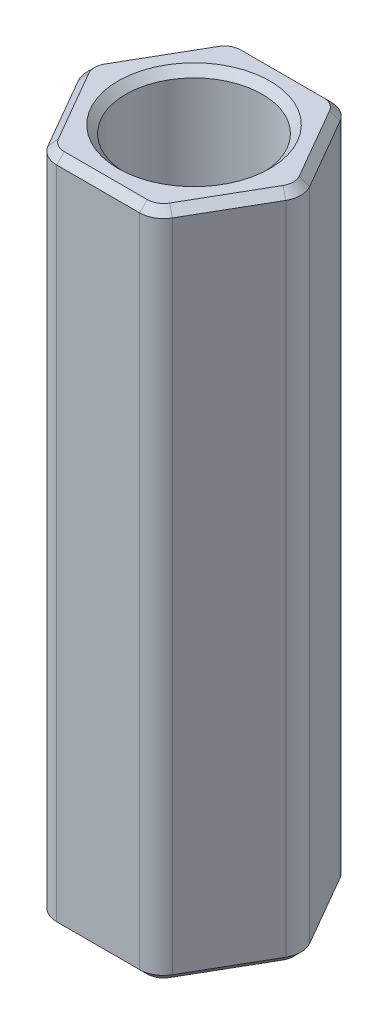
ISO-10303-21;
HEADER;
FILE_DESCRIPTION(('STEP AP214'),'2;1');
FILE_NAME('part.step','',(''),(''),'','','');
FILE_SCHEMA(('AUTOMOTIVE_DESIGN { 1 0 10303 214 1 1 1 1 }'));
ENDSEC;
DATA;
#1=APPLICATION_CONTEXT('core data for automotive mechanical design processes');
#2=APPLICATION_PROTOCOL_DEFINITION('international standard','automotive_design',2000,#1);
#3=PRODUCT_CONTEXT('',#1,'mechanical');
#4=PRODUCT('Part','Part','',(#3));
#5=PRODUCT_RELATED_PRODUCT_CATEGORY('part','',(#4));
#6=PRODUCT_DEFINITION_FORMATION('','',#4);
#7=PRODUCT_DEFINITION_CONTEXT('part definition',#1,'design');
#8=PRODUCT_DEFINITION('design','',#6,#7);
#9=PRODUCT_DEFINITION_SHAPE('','',#8);
#10=(LENGTH_UNIT() NAMED_UNIT(*) SI_UNIT(.MILLI.,.METRE.));
#11=(NAMED_UNIT(*) PLANE_ANGLE_UNIT() SI_UNIT($,.RADIAN.));
#12=(NAMED_UNIT(*) SI_UNIT($,.STERADIAN.) SOLID_ANGLE_UNIT());
#13=UNCERTAINTY_MEASURE_WITH_UNIT(LENGTH_MEASURE(1.E-05),#10,'distance_accuracy_value','');
#14=(GEOMETRIC_REPRESENTATION_CONTEXT(3) GLOBAL_UNCERTAINTY_ASSIGNED_CONTEXT((#13)) GLOBAL_UNIT_ASSIGNED_CONTEXT((#10,
#11,#12)) REPRESENTATION_CONTEXT('',''));
#15=CARTESIAN_POINT('',(0.,0.,0.));
#16=DIRECTION('',(0.,0.,1.));
#17=DIRECTION('',(1.,0.,0.));
#18=AXIS2_PLACEMENT_3D('',#15,#16,#17);
#19=CARTESIAN_POINT('',(1.83308710467706,5.55625,0.));
#20=DIRECTION('',(-0.866025403784439,0.,0.5));
#21=DIRECTION('',(0.5,0.,0.866025403784439));
#22=AXIS2_PLACEMENT_3D('',#19,#20,#21);
#23=PLANE('',#22);
#24=DIRECTION('',(0.,-1.,0.));
#25=VECTOR('',#24,1.);
#26=CARTESIAN_POINT('',(1.71851916063474,5.55625,-0.198437500000001));
#27=LINE('',#26,#25);
#28=CARTESIAN_POINT('',(1.71851916063474,5.42925,-0.198437500000001));
#29=VERTEX_POINT('',#28);
#30=CARTESIAN_POINT('',(1.71851916063474,-5.42925,-0.198437500000001));
#31=VERTEX_POINT('',#30);
#32=EDGE_CURVE('E404',#29,#31,#27,.T.);
#33=ORIENTED_EDGE('',*,*,#32,.T.);
#34=DIRECTION('',(-0.5,0.,-0.866025403784439));
#35=VECTOR('',#34,1.);
#36=CARTESIAN_POINT('',(1.83308710467706,-5.42925,0.));
#37=LINE('',#36,#35);
#38=CARTESIAN_POINT('',(1.03111149638085,-5.42925,-1.3890625));
#39=VERTEX_POINT('',#38);
#40=EDGE_CURVE('E325',#31,#39,#37,.T.);
#41=ORIENTED_EDGE('',*,*,#40,.T.);
#42=DIRECTION('',(0.,-1.,0.));
#43=VECTOR('',#42,1.);
#44=CARTESIAN_POINT('',(1.03111149638085,5.55625,-1.3890625));
#45=LINE('',#44,#43);
#46=CARTESIAN_POINT('',(1.03111149638085,5.42925,-1.3890625));
#47=VERTEX_POINT('',#46);
#48=EDGE_CURVE('E401',#39,#47,#45,.F.);
#49=ORIENTED_EDGE('',*,*,#48,.T.);
#50=DIRECTION('',(0.5,0.,0.866025403784439));
#51=VECTOR('',#50,1.);
#52=CARTESIAN_POINT('',(1.71851916063474,5.42925,-0.1984375));
#53=LINE('',#52,#51);
#54=EDGE_CURVE('E328',#47,#29,#53,.T.);
#55=ORIENTED_EDGE('',*,*,#54,.T.);
#56=EDGE_LOOP('',(#33,#41,#49,#55));
#57=FACE_BOUND('',#56,.T.);
#58=ADVANCED_FACE('F36',(#57),#23,.F.);
#59=CARTESIAN_POINT('',(0.91654355233853,5.55625,-1.5875));
#60=DIRECTION('',(0.,0.,1.));
#61=DIRECTION('',(1.,0.,0.));
#62=AXIS2_PLACEMENT_3D('',#59,#60,#61);
#63=PLANE('',#62);
#64=DIRECTION('',(0.,-1.,0.));
#65=VECTOR('',#64,1.);
#66=CARTESIAN_POINT('',(0.687407664253898,5.55625,-1.5875));
#67=LINE('',#66,#65);
#68=CARTESIAN_POINT('',(0.687407664253898,5.42925,-1.5875));
#69=VERTEX_POINT('',#68);
#70=CARTESIAN_POINT('',(0.687407664253898,-5.42925,-1.5875));
#71=VERTEX_POINT('',#70);
#72=EDGE_CURVE('E410',#69,#71,#67,.T.);
#73=ORIENTED_EDGE('',*,*,#72,.T.);
#74=DIRECTION('',(-1.,0.,0.));
#75=VECTOR('',#74,1.);
#76=CARTESIAN_POINT('',(0.91654355233853,-5.42925,-1.5875));
#77=LINE('',#76,#75);
#78=CARTESIAN_POINT('',(-0.687407664253898,-5.42925,-1.5875));
#79=VERTEX_POINT('',#78);
#80=EDGE_CURVE('E313',#71,#79,#77,.T.);
#81=ORIENTED_EDGE('',*,*,#80,.T.);
#82=DIRECTION('',(0.,-1.,0.));
#83=VECTOR('',#82,1.);
#84=CARTESIAN_POINT('',(-0.687407664253898,5.55625,-1.5875));
#85=LINE('',#84,#83);
#86=CARTESIAN_POINT('',(-0.687407664253898,5.42925,-1.5875));
#87=VERTEX_POINT('',#86);
#88=EDGE_CURVE('E407',#79,#87,#85,.F.);
#89=ORIENTED_EDGE('',*,*,#88,.T.);
#90=DIRECTION('',(1.,0.,0.));
#91=VECTOR('',#90,1.);
#92=CARTESIAN_POINT('',(0.687407664253898,5.42925,-1.5875));
#93=LINE('',#92,#91);
#94=EDGE_CURVE('E315',#87,#69,#93,.T.);
#95=ORIENTED_EDGE('',*,*,#94,.T.);
#96=EDGE_LOOP('',(#73,#81,#89,#95));
#97=FACE_BOUND('',#96,.T.);
#98=ADVANCED_FACE('F439',(#97),#63,.F.);
#99=CARTESIAN_POINT('',(-0.916543552338531,5.55625,-1.5875));
#100=DIRECTION('',(0.866025403784439,0.,0.499999999999999));
#101=DIRECTION('',(0.5,0.,-0.866025403784439));
#102=AXIS2_PLACEMENT_3D('',#99,#100,#101);
#103=PLANE('',#102);
#104=DIRECTION('',(0.,-1.,0.));
#105=VECTOR('',#104,1.);
#106=CARTESIAN_POINT('',(-1.03111149638085,5.55625,-1.3890625));
#107=LINE('',#106,#105);
#108=CARTESIAN_POINT('',(-1.03111149638085,5.42925,-1.3890625));
#109=VERTEX_POINT('',#108);
#110=CARTESIAN_POINT('',(-1.03111149638085,-5.42925,-1.3890625));
#111=VERTEX_POINT('',#110);
#112=EDGE_CURVE('E413',#109,#111,#107,.T.);
#113=ORIENTED_EDGE('',*,*,#112,.T.);
#114=DIRECTION('',(-0.5,0.,0.866025403784439));
#115=VECTOR('',#114,1.);
#116=CARTESIAN_POINT('',(-0.916543552338531,-5.42925,-1.5875));
#117=LINE('',#116,#115);
#118=CARTESIAN_POINT('',(-1.71851916063474,-5.42925,-0.1984375));
#119=VERTEX_POINT('',#118);
#120=EDGE_CURVE('E297',#111,#119,#117,.T.);
#121=ORIENTED_EDGE('',*,*,#120,.T.);
#122=DIRECTION('',(0.,-1.,0.));
#123=VECTOR('',#122,1.);
#124=CARTESIAN_POINT('',(-1.71851916063474,5.55625,-0.1984375));
#125=LINE('',#124,#123);
#126=CARTESIAN_POINT('',(-1.71851916063474,5.42925,-0.1984375));
#127=VERTEX_POINT('',#126);
#128=EDGE_CURVE('E255',#119,#127,#125,.F.);
#129=ORIENTED_EDGE('',*,*,#128,.T.);
#130=DIRECTION('',(0.5,0.,-0.866025403784439));
#131=VECTOR('',#130,1.);
#132=CARTESIAN_POINT('',(-1.03111149638085,5.42925,-1.3890625));
#133=LINE('',#132,#131);
#134=EDGE_CURVE('E299',#127,#109,#133,.T.);
#135=ORIENTED_EDGE('',*,*,#134,.T.);
#136=EDGE_LOOP('',(#113,#121,#129,#135));
#137=FACE_BOUND('',#136,.T.);
#138=ADVANCED_FACE('F419',(#137),#103,.F.);
#139=CARTESIAN_POINT('',(-1.83308710467706,5.55625,0.));
#140=DIRECTION('',(0.866025403784438,0.,-0.5));
#141=DIRECTION('',(-0.5,0.,-0.866025403784439));
#142=AXIS2_PLACEMENT_3D('',#139,#140,#141);
#143=PLANE('',#142);
#144=DIRECTION('',(0.,-1.,0.));
#145=VECTOR('',#144,1.);
#146=CARTESIAN_POINT('',(-1.71851916063474,5.55625,0.1984375));
#147=LINE('',#146,#145);
#148=CARTESIAN_POINT('',(-1.71851916063474,5.42925,0.1984375));
#149=VERTEX_POINT('',#148);
#150=CARTESIAN_POINT('',(-1.71851916063474,-5.42925,0.1984375));
#151=VERTEX_POINT('',#150);
#152=EDGE_CURVE('E387',#149,#151,#147,.T.);
#153=ORIENTED_EDGE('',*,*,#152,.T.);
#154=DIRECTION('',(0.5,0.,0.866025403784439));
#155=VECTOR('',#154,1.);
#156=CARTESIAN_POINT('',(-1.83308710467706,-5.42925,0.));
#157=LINE('',#156,#155);
#158=CARTESIAN_POINT('',(-1.03111149638085,-5.42925,1.3890625));
#159=VERTEX_POINT('',#158);
#160=EDGE_CURVE('E11',#151,#159,#157,.T.);
#161=ORIENTED_EDGE('',*,*,#160,.T.);
#162=DIRECTION('',(0.,-1.,0.));
#163=VECTOR('',#162,1.);
#164=CARTESIAN_POINT('',(-1.03111149638085,5.55625,1.3890625));
#165=LINE('',#164,#163);
#166=CARTESIAN_POINT('',(-1.03111149638085,5.42925,1.3890625));
#167=VERTEX_POINT('',#166);
#168=EDGE_CURVE('E385',#159,#167,#165,.F.);
#169=ORIENTED_EDGE('',*,*,#168,.T.);
#170=DIRECTION('',(-0.5,0.,-0.866025403784439));
#171=VECTOR('',#170,1.);
#172=CARTESIAN_POINT('',(-1.71851916063474,5.42925,0.1984375));
#173=LINE('',#172,#171);
#174=EDGE_CURVE('E45',#167,#149,#173,.T.);
#175=ORIENTED_EDGE('',*,*,#174,.T.);
#176=EDGE_LOOP('',(#153,#161,#169,#175));
#177=FACE_BOUND('',#176,.T.);
#178=ADVANCED_FACE('F817',(#177),#143,.F.);
#179=CARTESIAN_POINT('',(-0.916543552338529,5.55625,1.5875));
#180=DIRECTION('',(0.,0.,-1.));
#181=DIRECTION('',(-1.,0.,0.));
#182=AXIS2_PLACEMENT_3D('',#179,#180,#181);
#183=PLANE('',#182);
#184=DIRECTION('',(0.,-1.,0.));
#185=VECTOR('',#184,1.);
#186=CARTESIAN_POINT('',(-0.687407664253896,5.55625,1.5875));
#187=LINE('',#186,#185);
#188=CARTESIAN_POINT('',(-0.687407664253896,5.42925,1.5875));
#189=VERTEX_POINT('',#188);
#190=CARTESIAN_POINT('',(-0.687407664253896,-5.42925,1.5875));
#191=VERTEX_POINT('',#190);
#192=EDGE_CURVE('E392',#189,#191,#187,.T.);
#193=ORIENTED_EDGE('',*,*,#192,.T.);
#194=DIRECTION('',(1.,0.,0.));
#195=VECTOR('',#194,1.);
#196=CARTESIAN_POINT('',(-0.916543552338529,-5.42925,1.5875));
#197=LINE('',#196,#195);
#198=CARTESIAN_POINT('',(0.687407664253898,-5.42925,1.5875));
#199=VERTEX_POINT('',#198);
#200=EDGE_CURVE('E293',#191,#199,#197,.T.);
#201=ORIENTED_EDGE('',*,*,#200,.T.);
#202=DIRECTION('',(0.,-1.,0.));
#203=VECTOR('',#202,1.);
#204=CARTESIAN_POINT('',(0.687407664253898,5.55625,1.5875));
#205=LINE('',#204,#203);
#206=CARTESIAN_POINT('',(0.687407664253898,5.42925,1.5875));
#207=VERTEX_POINT('',#206);
#208=EDGE_CURVE('E389',#199,#207,#205,.F.);
#209=ORIENTED_EDGE('',*,*,#208,.T.);
#210=DIRECTION('',(-1.,0.,0.));
#211=VECTOR('',#210,1.);
#212=CARTESIAN_POINT('',(-0.687407664253896,5.42925,1.5875));
#213=LINE('',#212,#211);
#214=EDGE_CURVE('E295',#207,#189,#213,.T.);
#215=ORIENTED_EDGE('',*,*,#214,.T.);
#216=EDGE_LOOP('',(#193,#201,#209,#215));
#217=FACE_BOUND('',#216,.T.);
#218=ADVANCED_FACE('F808',(#217),#183,.F.);
#219=CARTESIAN_POINT('',(0.916543552338531,5.55625,1.5875));
#220=DIRECTION('',(-0.866025403784439,0.,-0.5));
#221=DIRECTION('',(-0.5,0.,0.866025403784439));
#222=AXIS2_PLACEMENT_3D('',#219,#220,#221);
#223=PLANE('',#222);
#224=DIRECTION('',(0.,-1.,0.));
#225=VECTOR('',#224,1.);
#226=CARTESIAN_POINT('',(1.03111149638085,5.55625,1.3890625));
#227=LINE('',#226,#225);
#228=CARTESIAN_POINT('',(1.03111149638085,5.42925,1.3890625));
#229=VERTEX_POINT('',#228);
#230=CARTESIAN_POINT('',(1.03111149638085,-5.42925,1.3890625));
#231=VERTEX_POINT('',#230);
#232=EDGE_CURVE('E398',#229,#231,#227,.T.);
#233=ORIENTED_EDGE('',*,*,#232,.T.);
#234=DIRECTION('',(0.5,0.,-0.866025403784439));
#235=VECTOR('',#234,1.);
#236=CARTESIAN_POINT('',(0.916543552338531,-5.42925,1.5875));
#237=LINE('',#236,#235);
#238=CARTESIAN_POINT('',(1.71851916063474,-5.42925,0.198437499999999));
#239=VERTEX_POINT('',#238);
#240=EDGE_CURVE('E309',#231,#239,#237,.T.);
#241=ORIENTED_EDGE('',*,*,#240,.T.);
#242=DIRECTION('',(0.,-1.,0.));
#243=VECTOR('',#242,1.);
#244=CARTESIAN_POINT('',(1.71851916063474,5.55625,0.198437499999999));
#245=LINE('',#244,#243);
#246=CARTESIAN_POINT('',(1.71851916063474,5.42925,0.198437499999999));
#247=VERTEX_POINT('',#246);
#248=EDGE_CURVE('E395',#239,#247,#245,.F.);
#249=ORIENTED_EDGE('',*,*,#248,.T.);
#250=DIRECTION('',(-0.5,0.,0.866025403784439));
#251=VECTOR('',#250,1.);
#252=CARTESIAN_POINT('',(1.03111149638085,5.42925,1.3890625));
#253=LINE('',#252,#251);
#254=EDGE_CURVE('E311',#247,#229,#253,.T.);
#255=ORIENTED_EDGE('',*,*,#254,.T.);
#256=EDGE_LOOP('',(#233,#241,#249,#255));
#257=FACE_BOUND('',#256,.T.);
#258=ADVANCED_FACE('F799',(#257),#223,.F.);
#259=CARTESIAN_POINT('',(0.,5.55625,0.));
#260=DIRECTION('',(0.,1.,0.));
#261=DIRECTION('',(0.,0.,1.));
#262=AXIS2_PLACEMENT_3D('',#259,#260,#261);
#263=PLANE('',#262);
#264=CARTESIAN_POINT('',(0.,5.55625,0.));
#265=DIRECTION('',(0.,1.,0.));
#266=DIRECTION('',(0.,0.,1.));
#267=AXIS2_PLACEMENT_3D('',#264,#265,#266);
#268=CIRCLE('',#267,1.25729999999998);
#269=CARTESIAN_POINT('',(0.,5.55625,1.25729999999998));
#270=VERTEX_POINT('',#269);
#271=EDGE_CURVE('E359',#270,#270,#268,.F.);
#272=ORIENTED_EDGE('',*,*,#271,.T.);
#273=EDGE_LOOP('',(#272));
#274=FACE_BOUND('',#273,.T.);
#275=CARTESIAN_POINT('',(1.3748153285078,5.55625,0.));
#276=DIRECTION('',(0.,1.,0.));
#277=DIRECTION('',(0.,0.,1.));
#278=AXIS2_PLACEMENT_3D('',#275,#276,#277);
#279=CIRCLE('',#278,0.269874999999997);
#280=CARTESIAN_POINT('',(1.60853393435412,5.55625,0.134937499999998));
#281=VERTEX_POINT('',#280);
#282=CARTESIAN_POINT('',(1.60853393435412,5.55625,-0.134937499999999));
#283=VERTEX_POINT('',#282);
#284=EDGE_CURVE('E367',#281,#283,#279,.T.);
#285=ORIENTED_EDGE('',*,*,#284,.T.);
#286=DIRECTION('',(-0.5,0.,-0.866025403784439));
#287=VECTOR('',#286,1.);
#288=CARTESIAN_POINT('',(0.921126270100221,5.55625,-1.3255625));
#289=LINE('',#288,#287);
#290=CARTESIAN_POINT('',(0.921126270100221,5.55625,-1.3255625));
#291=VERTEX_POINT('',#290);
#292=EDGE_CURVE('E362',#283,#291,#289,.T.);
#293=ORIENTED_EDGE('',*,*,#292,.T.);
#294=CARTESIAN_POINT('',(0.687407664253898,5.55625,-1.190625));
#295=DIRECTION('',(0.,1.,0.));
#296=DIRECTION('',(0.,0.,1.));
#297=AXIS2_PLACEMENT_3D('',#294,#295,#296);
#298=CIRCLE('',#297,0.269874999999997);
#299=CARTESIAN_POINT('',(0.687407664253898,5.55625,-1.4605));
#300=VERTEX_POINT('',#299);
#301=EDGE_CURVE('E365',#291,#300,#298,.T.);
#302=ORIENTED_EDGE('',*,*,#301,.T.);
#303=DIRECTION('',(-1.,0.,0.));
#304=VECTOR('',#303,1.);
#305=CARTESIAN_POINT('',(-0.687407664253898,5.55625,-1.4605));
#306=LINE('',#305,#304);
#307=CARTESIAN_POINT('',(-0.687407664253898,5.55625,-1.4605));
#308=VERTEX_POINT('',#307);
#309=EDGE_CURVE('E369',#300,#308,#306,.T.);
#310=ORIENTED_EDGE('',*,*,#309,.T.);
#311=CARTESIAN_POINT('',(-0.687407664253898,5.55625,-1.190625));
#312=DIRECTION('',(0.,1.,0.));
#313=DIRECTION('',(0.,0.,1.));
#314=AXIS2_PLACEMENT_3D('',#311,#312,#313);
#315=CIRCLE('',#314,0.269874999999997);
#316=CARTESIAN_POINT('',(-0.921126270100221,5.55625,-1.3255625));
#317=VERTEX_POINT('',#316);
#318=EDGE_CURVE('E373',#308,#317,#315,.T.);
#319=ORIENTED_EDGE('',*,*,#318,.T.);
#320=DIRECTION('',(-0.5,0.,0.866025403784439));
#321=VECTOR('',#320,1.);
#322=CARTESIAN_POINT('',(-1.60853393435412,5.55625,-0.134937499999998));
#323=LINE('',#322,#321);
#324=CARTESIAN_POINT('',(-1.60853393435412,5.55625,-0.134937499999998));
#325=VERTEX_POINT('',#324);
#326=EDGE_CURVE('E204',#317,#325,#323,.T.);
#327=ORIENTED_EDGE('',*,*,#326,.T.);
#328=CARTESIAN_POINT('',(-1.3748153285078,5.55625,0.));
#329=DIRECTION('',(0.,1.,0.));
#330=DIRECTION('',(0.,0.,1.));
#331=AXIS2_PLACEMENT_3D('',#328,#329,#330);
#332=CIRCLE('',#331,0.269874999999997);
#333=CARTESIAN_POINT('',(-1.60853393435412,5.55625,0.134937499999999));
#334=VERTEX_POINT('',#333);
#335=EDGE_CURVE('E198',#325,#334,#332,.T.);
#336=ORIENTED_EDGE('',*,*,#335,.T.);
#337=DIRECTION('',(0.5,0.,0.866025403784439));
#338=VECTOR('',#337,1.);
#339=CARTESIAN_POINT('',(-0.92112627010022,5.55625,1.3255625));
#340=LINE('',#339,#338);
#341=CARTESIAN_POINT('',(-0.92112627010022,5.55625,1.3255625));
#342=VERTEX_POINT('',#341);
#343=EDGE_CURVE('E201',#334,#342,#340,.T.);
#344=ORIENTED_EDGE('',*,*,#343,.T.);
#345=CARTESIAN_POINT('',(-0.687407664253897,5.55625,1.190625));
#346=DIRECTION('',(0.,1.,0.));
#347=DIRECTION('',(0.,0.,1.));
#348=AXIS2_PLACEMENT_3D('',#345,#346,#347);
#349=CIRCLE('',#348,0.269874999999997);
#350=CARTESIAN_POINT('',(-0.687407664253896,5.55625,1.4605));
#351=VERTEX_POINT('',#350);
#352=EDGE_CURVE('E210',#342,#351,#349,.T.);
#353=ORIENTED_EDGE('',*,*,#352,.T.);
#354=DIRECTION('',(1.,0.,0.));
#355=VECTOR('',#354,1.);
#356=CARTESIAN_POINT('',(0.687407664253898,5.55625,1.4605));
#357=LINE('',#356,#355);
#358=CARTESIAN_POINT('',(0.687407664253898,5.55625,1.4605));
#359=VERTEX_POINT('',#358);
#360=EDGE_CURVE('E209',#351,#359,#357,.T.);
#361=ORIENTED_EDGE('',*,*,#360,.T.);
#362=CARTESIAN_POINT('',(0.687407664253898,5.55625,1.190625));
#363=DIRECTION('',(0.,1.,0.));
#364=DIRECTION('',(0.,0.,1.));
#365=AXIS2_PLACEMENT_3D('',#362,#363,#364);
#366=CIRCLE('',#365,0.269874999999997);
#367=CARTESIAN_POINT('',(0.921126270100221,5.55625,1.3255625));
#368=VERTEX_POINT('',#367);
#369=EDGE_CURVE('E375',#359,#368,#366,.T.);
#370=ORIENTED_EDGE('',*,*,#369,.T.);
#371=DIRECTION('',(0.5,0.,-0.866025403784439));
#372=VECTOR('',#371,1.);
#373=CARTESIAN_POINT('',(1.60853393435412,5.55625,0.134937499999998));
#374=LINE('',#373,#372);
#375=EDGE_CURVE('E371',#368,#281,#374,.T.);
#376=ORIENTED_EDGE('',*,*,#375,.T.);
#377=EDGE_LOOP('',(#285,#293,#302,#310,#319,#327,#336,#344,#353,#361,#370,#376));
#378=FACE_BOUND('',#377,.T.);
#379=ADVANCED_FACE('F200',(#274,#378),#263,.T.);
#380=CARTESIAN_POINT('',(0.,-5.55625,0.));
#381=DIRECTION('',(0.,1.,0.));
#382=DIRECTION('',(0.,0.,1.));
#383=AXIS2_PLACEMENT_3D('',#380,#381,#382);
#384=PLANE('',#383);
#385=CARTESIAN_POINT('',(0.,-5.55625,0.));
#386=DIRECTION('',(0.,1.,0.));
#387=DIRECTION('',(0.,0.,1.));
#388=AXIS2_PLACEMENT_3D('',#385,#386,#387);
#389=CIRCLE('',#388,1.2573);
#390=CARTESIAN_POINT('',(0.,-5.55625,1.2573));
#391=VERTEX_POINT('',#390);
#392=EDGE_CURVE('E331',#391,#391,#389,.T.);
#393=ORIENTED_EDGE('',*,*,#392,.T.);
#394=EDGE_LOOP('',(#393));
#395=FACE_BOUND('',#394,.T.);
#396=CARTESIAN_POINT('',(0.687407664253898,-5.55625,-1.190625));
#397=DIRECTION('',(0.,1.,0.));
#398=DIRECTION('',(0.,0.,1.));
#399=AXIS2_PLACEMENT_3D('',#396,#397,#398);
#400=CIRCLE('',#399,0.269874999999995);
#401=CARTESIAN_POINT('',(0.687407664253898,-5.55625,-1.46049999999999));
#402=VERTEX_POINT('',#401);
#403=CARTESIAN_POINT('',(0.921126270100219,-5.55625,-1.3255625));
#404=VERTEX_POINT('',#403);
#405=EDGE_CURVE('E337',#402,#404,#400,.F.);
#406=ORIENTED_EDGE('',*,*,#405,.T.);
#407=DIRECTION('',(0.5,0.,0.866025403784439));
#408=VECTOR('',#407,1.);
#409=CARTESIAN_POINT('',(1.26483010222717,-5.55625,-0.730249999999997));
#410=LINE('',#409,#408);
#411=CARTESIAN_POINT('',(1.60853393435412,-5.55625,-0.134937499999998));
#412=VERTEX_POINT('',#411);
#413=EDGE_CURVE('E334',#404,#412,#410,.T.);
#414=ORIENTED_EDGE('',*,*,#413,.T.);
#415=CARTESIAN_POINT('',(1.3748153285078,-5.55625,0.));
#416=DIRECTION('',(0.,1.,0.));
#417=DIRECTION('',(0.,0.,1.));
#418=AXIS2_PLACEMENT_3D('',#415,#416,#417);
#419=CIRCLE('',#418,0.269874999999995);
#420=CARTESIAN_POINT('',(1.60853393435412,-5.55625,0.134937499999997));
#421=VERTEX_POINT('',#420);
#422=EDGE_CURVE('E339',#412,#421,#419,.F.);
#423=ORIENTED_EDGE('',*,*,#422,.T.);
#424=DIRECTION('',(-0.5,0.,0.866025403784439));
#425=VECTOR('',#424,1.);
#426=CARTESIAN_POINT('',(1.26483010222717,-5.55625,0.730249999999997));
#427=LINE('',#426,#425);
#428=CARTESIAN_POINT('',(0.921126270100219,-5.55625,1.3255625));
#429=VERTEX_POINT('',#428);
#430=EDGE_CURVE('E343',#421,#429,#427,.T.);
#431=ORIENTED_EDGE('',*,*,#430,.T.);
#432=CARTESIAN_POINT('',(0.687407664253898,-5.55625,1.190625));
#433=DIRECTION('',(0.,1.,0.));
#434=DIRECTION('',(0.,0.,1.));
#435=AXIS2_PLACEMENT_3D('',#432,#433,#434);
#436=CIRCLE('',#435,0.269874999999995);
#437=CARTESIAN_POINT('',(0.687407664253898,-5.55625,1.46049999999999));
#438=VERTEX_POINT('',#437);
#439=EDGE_CURVE('E347',#429,#438,#436,.F.);
#440=ORIENTED_EDGE('',*,*,#439,.T.);
#441=DIRECTION('',(-1.,0.,0.));
#442=VECTOR('',#441,1.);
#443=CARTESIAN_POINT('',(0.,-5.55625,1.46049999999999));
#444=LINE('',#443,#442);
#445=CARTESIAN_POINT('',(-0.687407664253896,-5.55625,1.46049999999999));
#446=VERTEX_POINT('',#445);
#447=EDGE_CURVE('E351',#438,#446,#444,.T.);
#448=ORIENTED_EDGE('',*,*,#447,.T.);
#449=CARTESIAN_POINT('',(-0.687407664253897,-5.55625,1.190625));
#450=DIRECTION('',(0.,1.,0.));
#451=DIRECTION('',(0.,0.,1.));
#452=AXIS2_PLACEMENT_3D('',#449,#450,#451);
#453=CIRCLE('',#452,0.269874999999995);
#454=CARTESIAN_POINT('',(-0.921126270100218,-5.55625,1.3255625));
#455=VERTEX_POINT('',#454);
#456=EDGE_CURVE('E355',#446,#455,#453,.F.);
#457=ORIENTED_EDGE('',*,*,#456,.T.);
#458=DIRECTION('',(-0.5,0.,-0.866025403784439));
#459=VECTOR('',#458,1.);
#460=CARTESIAN_POINT('',(-1.26483010222717,-5.55625,0.730249999999997));
#461=LINE('',#460,#459);
#462=CARTESIAN_POINT('',(-1.60853393435412,-5.55625,0.134937499999998));
#463=VERTEX_POINT('',#462);
#464=EDGE_CURVE('E357',#455,#463,#461,.T.);
#465=ORIENTED_EDGE('',*,*,#464,.T.);
#466=CARTESIAN_POINT('',(-1.3748153285078,-5.55625,0.));
#467=DIRECTION('',(0.,1.,0.));
#468=DIRECTION('',(0.,0.,1.));
#469=AXIS2_PLACEMENT_3D('',#466,#467,#468);
#470=CIRCLE('',#469,0.269874999999995);
#471=CARTESIAN_POINT('',(-1.60853393435412,-5.55625,-0.134937499999997));
#472=VERTEX_POINT('',#471);
#473=EDGE_CURVE('E353',#463,#472,#470,.F.);
#474=ORIENTED_EDGE('',*,*,#473,.T.);
#475=DIRECTION('',(0.5,0.,-0.866025403784439));
#476=VECTOR('',#475,1.);
#477=CARTESIAN_POINT('',(-1.26483010222717,-5.55625,-0.730249999999996));
#478=LINE('',#477,#476);
#479=CARTESIAN_POINT('',(-0.921126270100219,-5.55625,-1.3255625));
#480=VERTEX_POINT('',#479);
#481=EDGE_CURVE('E349',#472,#480,#478,.T.);
#482=ORIENTED_EDGE('',*,*,#481,.T.);
#483=CARTESIAN_POINT('',(-0.687407664253898,-5.55625,-1.190625));
#484=DIRECTION('',(0.,1.,0.));
#485=DIRECTION('',(0.,0.,1.));
#486=AXIS2_PLACEMENT_3D('',#483,#484,#485);
#487=CIRCLE('',#486,0.269874999999995);
#488=CARTESIAN_POINT('',(-0.687407664253898,-5.55625,-1.46049999999999));
#489=VERTEX_POINT('',#488);
#490=EDGE_CURVE('E345',#480,#489,#487,.F.);
#491=ORIENTED_EDGE('',*,*,#490,.T.);
#492=DIRECTION('',(1.,0.,0.));
#493=VECTOR('',#492,1.);
#494=CARTESIAN_POINT('',(0.,-5.55625,-1.46049999999999));
#495=LINE('',#494,#493);
#496=EDGE_CURVE('E341',#489,#402,#495,.T.);
#497=ORIENTED_EDGE('',*,*,#496,.T.);
#498=EDGE_LOOP('',(#406,#414,#423,#431,#440,#448,#457,#465,#474,#482,#491,#497));
#499=FACE_BOUND('',#498,.T.);
#500=ADVANCED_FACE('F454',(#395,#499),#384,.F.);
#501=CARTESIAN_POINT('',(0.,5.55625,0.));
#502=DIRECTION('',(0.,1.,0.));
#503=DIRECTION('',(0.,0.,1.));
#504=AXIS2_PLACEMENT_3D('',#501,#502,#503);
#505=CYLINDRICAL_SURFACE('',#504,1.13029999999999);
#506=CARTESIAN_POINT('',(0.,5.42925000000001,0.));
#507=DIRECTION('',(0.,1.,0.));
#508=DIRECTION('',(0.,0.,1.));
#509=AXIS2_PLACEMENT_3D('',#506,#507,#508);
#510=CIRCLE('',#509,1.13029999999999);
#511=CARTESIAN_POINT('',(0.,5.42925000000001,1.13029999999999));
#512=VERTEX_POINT('',#511);
#513=EDGE_CURVE('E219',#512,#512,#510,.T.);
#514=ORIENTED_EDGE('',*,*,#513,.T.);
#515=EDGE_LOOP('',(#514));
#516=FACE_BOUND('',#515,.T.);
#517=CARTESIAN_POINT('',(0.,-5.42924999999999,0.));
#518=DIRECTION('',(0.,1.,0.));
#519=DIRECTION('',(0.,0.,1.));
#520=AXIS2_PLACEMENT_3D('',#517,#518,#519);
#521=CIRCLE('',#520,1.13029999999999);
#522=CARTESIAN_POINT('',(0.,-5.42924999999999,1.13029999999999));
#523=VERTEX_POINT('',#522);
#524=EDGE_CURVE('E382',#523,#523,#521,.F.);
#525=ORIENTED_EDGE('',*,*,#524,.T.);
#526=EDGE_LOOP('',(#525));
#527=FACE_BOUND('',#526,.T.);
#528=ADVANCED_FACE('F519',(#516,#527),#505,.F.);
#529=CARTESIAN_POINT('',(-0.687407664253898,5.55625,-1.190625));
#530=DIRECTION('',(0.,-1.,0.));
#531=DIRECTION('',(0.,0.,-1.));
#532=AXIS2_PLACEMENT_3D('',#529,#530,#531);
#533=CYLINDRICAL_SURFACE('',#532,0.396875);
#534=ORIENTED_EDGE('',*,*,#88,.F.);
#535=CARTESIAN_POINT('',(-0.687407664253898,-5.42925,-1.190625));
#536=DIRECTION('',(0.,1.,0.));
#537=DIRECTION('',(0.,0.,1.));
#538=AXIS2_PLACEMENT_3D('',#535,#536,#537);
#539=CIRCLE('',#538,0.396875);
#540=EDGE_CURVE('E305',#79,#111,#539,.T.);
#541=ORIENTED_EDGE('',*,*,#540,.T.);
#542=ORIENTED_EDGE('',*,*,#112,.F.);
#543=CARTESIAN_POINT('',(-0.687407664253898,5.42925,-1.190625));
#544=DIRECTION('',(0.,1.,0.));
#545=DIRECTION('',(0.,0.,1.));
#546=AXIS2_PLACEMENT_3D('',#543,#544,#545);
#547=CIRCLE('',#546,0.396875);
#548=EDGE_CURVE('E307',#109,#87,#547,.F.);
#549=ORIENTED_EDGE('',*,*,#548,.T.);
#550=EDGE_LOOP('',(#534,#541,#542,#549));
#551=FACE_BOUND('',#550,.T.);
#552=ADVANCED_FACE('F436',(#551),#533,.T.);
#553=CARTESIAN_POINT('',(0.687407664253898,5.55625,-1.190625));
#554=DIRECTION('',(0.,-1.,0.));
#555=DIRECTION('',(0.,0.,-1.));
#556=AXIS2_PLACEMENT_3D('',#553,#554,#555);
#557=CYLINDRICAL_SURFACE('',#556,0.396875);
#558=ORIENTED_EDGE('',*,*,#48,.F.);
#559=CARTESIAN_POINT('',(0.687407664253898,-5.42925,-1.190625));
#560=DIRECTION('',(0.,1.,0.));
#561=DIRECTION('',(0.,0.,1.));
#562=AXIS2_PLACEMENT_3D('',#559,#560,#561);
#563=CIRCLE('',#562,0.396875);
#564=EDGE_CURVE('E321',#39,#71,#563,.T.);
#565=ORIENTED_EDGE('',*,*,#564,.T.);
#566=ORIENTED_EDGE('',*,*,#72,.F.);
#567=CARTESIAN_POINT('',(0.687407664253898,5.42925,-1.190625));
#568=DIRECTION('',(0.,1.,0.));
#569=DIRECTION('',(0.,0.,1.));
#570=AXIS2_PLACEMENT_3D('',#567,#568,#569);
#571=CIRCLE('',#570,0.396875);
#572=EDGE_CURVE('E323',#69,#47,#571,.F.);
#573=ORIENTED_EDGE('',*,*,#572,.T.);
#574=EDGE_LOOP('',(#558,#565,#566,#573));
#575=FACE_BOUND('',#574,.T.);
#576=ADVANCED_FACE('F518',(#575),#557,.T.);
#577=CARTESIAN_POINT('',(1.3748153285078,5.55625,0.));
#578=DIRECTION('',(0.,-1.,0.));
#579=DIRECTION('',(0.,0.,-1.));
#580=AXIS2_PLACEMENT_3D('',#577,#578,#579);
#581=CYLINDRICAL_SURFACE('',#580,0.396875);
#582=ORIENTED_EDGE('',*,*,#248,.F.);
#583=CARTESIAN_POINT('',(1.3748153285078,-5.42925,0.));
#584=DIRECTION('',(0.,1.,0.));
#585=DIRECTION('',(0.,0.,1.));
#586=AXIS2_PLACEMENT_3D('',#583,#584,#585);
#587=CIRCLE('',#586,0.396875);
#588=EDGE_CURVE('E317',#239,#31,#587,.T.);
#589=ORIENTED_EDGE('',*,*,#588,.T.);
#590=ORIENTED_EDGE('',*,*,#32,.F.);
#591=CARTESIAN_POINT('',(1.3748153285078,5.42925,0.));
#592=DIRECTION('',(0.,1.,0.));
#593=DIRECTION('',(0.,0.,1.));
#594=AXIS2_PLACEMENT_3D('',#591,#592,#593);
#595=CIRCLE('',#594,0.396875);
#596=EDGE_CURVE('E319',#29,#247,#595,.F.);
#597=ORIENTED_EDGE('',*,*,#596,.T.);
#598=EDGE_LOOP('',(#582,#589,#590,#597));
#599=FACE_BOUND('',#598,.T.);
#600=ADVANCED_FACE('F522',(#599),#581,.T.);
#601=CARTESIAN_POINT('',(0.687407664253898,5.55625,1.190625));
#602=DIRECTION('',(0.,-1.,0.));
#603=DIRECTION('',(0.,0.,-1.));
#604=AXIS2_PLACEMENT_3D('',#601,#602,#603);
#605=CYLINDRICAL_SURFACE('',#604,0.396875);
#606=ORIENTED_EDGE('',*,*,#208,.F.);
#607=CARTESIAN_POINT('',(0.687407664253898,-5.42925,1.190625));
#608=DIRECTION('',(0.,1.,0.));
#609=DIRECTION('',(0.,0.,1.));
#610=AXIS2_PLACEMENT_3D('',#607,#608,#609);
#611=CIRCLE('',#610,0.396875);
#612=EDGE_CURVE('E301',#199,#231,#611,.T.);
#613=ORIENTED_EDGE('',*,*,#612,.T.);
#614=ORIENTED_EDGE('',*,*,#232,.F.);
#615=CARTESIAN_POINT('',(0.687407664253898,5.42925,1.190625));
#616=DIRECTION('',(0.,1.,0.));
#617=DIRECTION('',(0.,0.,1.));
#618=AXIS2_PLACEMENT_3D('',#615,#616,#617);
#619=CIRCLE('',#618,0.396875);
#620=EDGE_CURVE('E303',#229,#207,#619,.F.);
#621=ORIENTED_EDGE('',*,*,#620,.T.);
#622=EDGE_LOOP('',(#606,#613,#614,#621));
#623=FACE_BOUND('',#622,.T.);
#624=ADVANCED_FACE('F526',(#623),#605,.T.);
#625=CARTESIAN_POINT('',(-0.687407664253897,5.55625,1.190625));
#626=DIRECTION('',(0.,-1.,0.));
#627=DIRECTION('',(0.,0.,-1.));
#628=AXIS2_PLACEMENT_3D('',#625,#626,#627);
#629=CYLINDRICAL_SURFACE('',#628,0.396875);
#630=ORIENTED_EDGE('',*,*,#168,.F.);
#631=CARTESIAN_POINT('',(-0.687407664253897,-5.42925,1.190625));
#632=DIRECTION('',(0.,1.,0.));
#633=DIRECTION('',(0.,0.,1.));
#634=AXIS2_PLACEMENT_3D('',#631,#632,#633);
#635=CIRCLE('',#634,0.396875);
#636=EDGE_CURVE('E287',#159,#191,#635,.T.);
#637=ORIENTED_EDGE('',*,*,#636,.T.);
#638=ORIENTED_EDGE('',*,*,#192,.F.);
#639=CARTESIAN_POINT('',(-0.687407664253897,5.42925,1.190625));
#640=DIRECTION('',(0.,1.,0.));
#641=DIRECTION('',(0.,0.,1.));
#642=AXIS2_PLACEMENT_3D('',#639,#640,#641);
#643=CIRCLE('',#642,0.396875);
#644=EDGE_CURVE('E53',#189,#167,#643,.F.);
#645=ORIENTED_EDGE('',*,*,#644,.T.);
#646=EDGE_LOOP('',(#630,#637,#638,#645));
#647=FACE_BOUND('',#646,.T.);
#648=ADVANCED_FACE('F530',(#647),#629,.T.);
#649=CARTESIAN_POINT('',(-1.3748153285078,5.55625,0.));
#650=DIRECTION('',(0.,-1.,0.));
#651=DIRECTION('',(0.,0.,-1.));
#652=AXIS2_PLACEMENT_3D('',#649,#650,#651);
#653=CYLINDRICAL_SURFACE('',#652,0.396875);
#654=ORIENTED_EDGE('',*,*,#128,.F.);
#655=CARTESIAN_POINT('',(-1.3748153285078,-5.42925,0.));
#656=DIRECTION('',(0.,1.,0.));
#657=DIRECTION('',(0.,0.,1.));
#658=AXIS2_PLACEMENT_3D('',#655,#656,#657);
#659=CIRCLE('',#658,0.396875);
#660=EDGE_CURVE('E290',#119,#151,#659,.T.);
#661=ORIENTED_EDGE('',*,*,#660,.T.);
#662=ORIENTED_EDGE('',*,*,#152,.F.);
#663=CARTESIAN_POINT('',(-1.3748153285078,5.42925,0.));
#664=DIRECTION('',(0.,1.,0.));
#665=DIRECTION('',(0.,0.,1.));
#666=AXIS2_PLACEMENT_3D('',#663,#664,#665);
#667=CIRCLE('',#666,0.396875);
#668=EDGE_CURVE('E222',#149,#127,#667,.F.);
#669=ORIENTED_EDGE('',*,*,#668,.T.);
#670=EDGE_LOOP('',(#654,#661,#662,#669));
#671=FACE_BOUND('',#670,.T.);
#672=ADVANCED_FACE('F534',(#671),#653,.T.);
#673=CARTESIAN_POINT('',(0.,5.42925000000001,0.));
#674=DIRECTION('',(0.,1.,0.));
#675=DIRECTION('',(0.,0.,1.));
#676=AXIS2_PLACEMENT_3D('',#673,#674,#675);
#677=CONICAL_SURFACE('',#676,1.13029999999999,0.78539816339745);
#678=ORIENTED_EDGE('',*,*,#271,.F.);
#679=EDGE_LOOP('',(#678));
#680=FACE_BOUND('',#679,.T.);
#681=ORIENTED_EDGE('',*,*,#513,.F.);
#682=EDGE_LOOP('',(#681));
#683=FACE_BOUND('',#682,.T.);
#684=ADVANCED_FACE('F537',(#680,#683),#677,.F.);
#685=CARTESIAN_POINT('',(0.,-5.55625,0.));
#686=DIRECTION('',(0.,-1.,0.));
#687=DIRECTION('',(0.,0.,-1.));
#688=AXIS2_PLACEMENT_3D('',#685,#686,#687);
#689=CONICAL_SURFACE('',#688,1.2573,0.78539816339745);
#690=ORIENTED_EDGE('',*,*,#524,.F.);
#691=EDGE_LOOP('',(#690));
#692=FACE_BOUND('',#691,.T.);
#693=ORIENTED_EDGE('',*,*,#392,.F.);
#694=EDGE_LOOP('',(#693));
#695=FACE_BOUND('',#694,.T.);
#696=ADVANCED_FACE('F540',(#692,#695),#689,.F.);
#697=CARTESIAN_POINT('',(-1.83308710467706,-5.42925,0.));
#698=DIRECTION('',(0.612372435695792,0.70710678118655,-0.353553390593273));
#699=DIRECTION('',(0.5,0.,0.866025403784439));
#700=AXIS2_PLACEMENT_3D('',#697,#698,#699);
#701=PLANE('',#700);
#702=DIRECTION('',(-0.612372435695797,0.707106781186545,0.353553390593276));
#703=VECTOR('',#702,1.);
#704=CARTESIAN_POINT('',(-1.60853393435412,-5.55625,0.134937499999998));
#705=LINE('',#704,#703);
#706=EDGE_CURVE('E256',#463,#151,#705,.T.);
#707=ORIENTED_EDGE('',*,*,#706,.F.);
#708=ORIENTED_EDGE('',*,*,#464,.F.);
#709=DIRECTION('',(0.612372435695796,-0.707106781186546,-0.353553390593274));
#710=VECTOR('',#709,1.);
#711=CARTESIAN_POINT('',(-1.03111149638085,-5.42925,1.3890625));
#712=LINE('',#711,#710);
#713=EDGE_CURVE('E252',#159,#455,#712,.T.);
#714=ORIENTED_EDGE('',*,*,#713,.F.);
#715=ORIENTED_EDGE('',*,*,#160,.F.);
#716=EDGE_LOOP('',(#707,#708,#714,#715));
#717=FACE_BOUND('',#716,.T.);
#718=ADVANCED_FACE('F487',(#717),#701,.F.);
#719=CARTESIAN_POINT('',(-0.687407664253897,-5.55625,1.190625));
#720=DIRECTION('',(0.,1.,0.));
#721=DIRECTION('',(0.,0.,1.));
#722=AXIS2_PLACEMENT_3D('',#719,#720,#721);
#723=CONICAL_SURFACE('',#722,0.269874999999995,0.785398163397453);
#724=ORIENTED_EDGE('',*,*,#713,.T.);
#725=ORIENTED_EDGE('',*,*,#456,.F.);
#726=DIRECTION('',(0.,-0.707106781186544,-0.70710678118655));
#727=VECTOR('',#726,1.);
#728=CARTESIAN_POINT('',(-0.687407664253896,-5.42925,1.5875));
#729=LINE('',#728,#727);
#730=EDGE_CURVE('E259',#191,#446,#729,.T.);
#731=ORIENTED_EDGE('',*,*,#730,.F.);
#732=ORIENTED_EDGE('',*,*,#636,.F.);
#733=EDGE_LOOP('',(#724,#725,#731,#732));
#734=FACE_BOUND('',#733,.T.);
#735=ADVANCED_FACE('F482',(#734),#723,.T.);
#736=CARTESIAN_POINT('',(-1.3748153285078,-5.55625,0.));
#737=DIRECTION('',(0.,1.,0.));
#738=DIRECTION('',(0.,0.,1.));
#739=AXIS2_PLACEMENT_3D('',#736,#737,#738);
#740=CONICAL_SURFACE('',#739,0.269874999999995,0.785398163397452);
#741=ORIENTED_EDGE('',*,*,#706,.T.);
#742=ORIENTED_EDGE('',*,*,#660,.F.);
#743=DIRECTION('',(-0.612372435695797,0.707106781186545,-0.353553390593274));
#744=VECTOR('',#743,1.);
#745=CARTESIAN_POINT('',(-1.60853393435412,-5.55625,-0.134937499999997));
#746=LINE('',#745,#744);
#747=EDGE_CURVE('E262',#472,#119,#746,.T.);
#748=ORIENTED_EDGE('',*,*,#747,.F.);
#749=ORIENTED_EDGE('',*,*,#473,.F.);
#750=EDGE_LOOP('',(#741,#742,#748,#749));
#751=FACE_BOUND('',#750,.T.);
#752=ADVANCED_FACE('F491',(#751),#740,.T.);
#753=CARTESIAN_POINT('',(-0.916543552338529,-5.42925,1.5875));
#754=DIRECTION('',(0.,0.70710678118655,-0.707106781186544));
#755=DIRECTION('',(1.,0.,0.));
#756=AXIS2_PLACEMENT_3D('',#753,#754,#755);
#757=PLANE('',#756);
#758=ORIENTED_EDGE('',*,*,#730,.T.);
#759=ORIENTED_EDGE('',*,*,#447,.F.);
#760=DIRECTION('',(0.,-0.707106781186545,-0.70710678118655));
#761=VECTOR('',#760,1.);
#762=CARTESIAN_POINT('',(0.687407664253898,-5.42925,1.5875));
#763=LINE('',#762,#761);
#764=EDGE_CURVE('E265',#199,#438,#763,.T.);
#765=ORIENTED_EDGE('',*,*,#764,.F.);
#766=ORIENTED_EDGE('',*,*,#200,.F.);
#767=EDGE_LOOP('',(#758,#759,#765,#766));
#768=FACE_BOUND('',#767,.T.);
#769=ADVANCED_FACE('F477',(#768),#757,.F.);
#770=CARTESIAN_POINT('',(-0.916543552338531,-5.42925,-1.5875));
#771=DIRECTION('',(0.612372435695793,0.70710678118655,0.353553390593272));
#772=DIRECTION('',(-0.5,0.,0.866025403784439));
#773=AXIS2_PLACEMENT_3D('',#770,#771,#772);
#774=PLANE('',#773);
#775=ORIENTED_EDGE('',*,*,#747,.T.);
#776=ORIENTED_EDGE('',*,*,#120,.F.);
#777=DIRECTION('',(-0.612372435695797,0.707106781186545,-0.353553390593275));
#778=VECTOR('',#777,1.);
#779=CARTESIAN_POINT('',(-0.921126270100219,-5.55625,-1.3255625));
#780=LINE('',#779,#778);
#781=EDGE_CURVE('E268',#480,#111,#780,.T.);
#782=ORIENTED_EDGE('',*,*,#781,.F.);
#783=ORIENTED_EDGE('',*,*,#481,.F.);
#784=EDGE_LOOP('',(#775,#776,#782,#783));
#785=FACE_BOUND('',#784,.T.);
#786=ADVANCED_FACE('F496',(#785),#774,.F.);
#787=CARTESIAN_POINT('',(0.687407664253898,-5.55625,1.190625));
#788=DIRECTION('',(0.,1.,0.));
#789=DIRECTION('',(0.,0.,1.));
#790=AXIS2_PLACEMENT_3D('',#787,#788,#789);
#791=CONICAL_SURFACE('',#790,0.269874999999995,0.785398163397453);
#792=ORIENTED_EDGE('',*,*,#764,.T.);
#793=ORIENTED_EDGE('',*,*,#439,.F.);
#794=DIRECTION('',(-0.612372435695798,-0.707106781186544,-0.353553390593275));
#795=VECTOR('',#794,1.);
#796=CARTESIAN_POINT('',(1.03111149638085,-5.42925,1.3890625));
#797=LINE('',#796,#795);
#798=EDGE_CURVE('E271',#231,#429,#797,.T.);
#799=ORIENTED_EDGE('',*,*,#798,.F.);
#800=ORIENTED_EDGE('',*,*,#612,.F.);
#801=EDGE_LOOP('',(#792,#793,#799,#800));
#802=FACE_BOUND('',#801,.T.);
#803=ADVANCED_FACE('F472',(#802),#791,.T.);
#804=CARTESIAN_POINT('',(-0.687407664253898,-5.55625,-1.190625));
#805=DIRECTION('',(0.,1.,0.));
#806=DIRECTION('',(0.,0.,1.));
#807=AXIS2_PLACEMENT_3D('',#804,#805,#806);
#808=CONICAL_SURFACE('',#807,0.269874999999995,0.785398163397452);
#809=ORIENTED_EDGE('',*,*,#781,.T.);
#810=ORIENTED_EDGE('',*,*,#540,.F.);
#811=DIRECTION('',(0.,0.707106781186544,-0.70710678118655));
#812=VECTOR('',#811,1.);
#813=CARTESIAN_POINT('',(-0.687407664253898,-5.55625,-1.46049999999999));
#814=LINE('',#813,#812);
#815=EDGE_CURVE('E274',#489,#79,#814,.T.);
#816=ORIENTED_EDGE('',*,*,#815,.F.);
#817=ORIENTED_EDGE('',*,*,#490,.F.);
#818=EDGE_LOOP('',(#809,#810,#816,#817));
#819=FACE_BOUND('',#818,.T.);
#820=ADVANCED_FACE('F498',(#819),#808,.T.);
#821=CARTESIAN_POINT('',(0.916543552338531,-5.42925,1.5875));
#822=DIRECTION('',(-0.612372435695792,0.707106781186551,-0.353553390593272));
#823=DIRECTION('',(0.5,0.,-0.866025403784439));
#824=AXIS2_PLACEMENT_3D('',#821,#822,#823);
#825=PLANE('',#824);
#826=ORIENTED_EDGE('',*,*,#798,.T.);
#827=ORIENTED_EDGE('',*,*,#430,.F.);
#828=DIRECTION('',(-0.612372435695797,-0.707106781186544,-0.353553390593275));
#829=VECTOR('',#828,1.);
#830=CARTESIAN_POINT('',(1.71851916063474,-5.42925,0.198437499999999));
#831=LINE('',#830,#829);
#832=EDGE_CURVE('E277',#239,#421,#831,.T.);
#833=ORIENTED_EDGE('',*,*,#832,.F.);
#834=ORIENTED_EDGE('',*,*,#240,.F.);
#835=EDGE_LOOP('',(#826,#827,#833,#834));
#836=FACE_BOUND('',#835,.T.);
#837=ADVANCED_FACE('F467',(#836),#825,.F.);
#838=CARTESIAN_POINT('',(0.91654355233853,-5.42925,-1.5875));
#839=DIRECTION('',(0.,0.707106781186551,0.707106781186544));
#840=DIRECTION('',(-1.,0.,0.));
#841=AXIS2_PLACEMENT_3D('',#838,#839,#840);
#842=PLANE('',#841);
#843=ORIENTED_EDGE('',*,*,#815,.T.);
#844=ORIENTED_EDGE('',*,*,#80,.F.);
#845=DIRECTION('',(0.,0.707106781186544,-0.707106781186551));
#846=VECTOR('',#845,1.);
#847=CARTESIAN_POINT('',(0.687407664253898,-5.55625,-1.46049999999999));
#848=LINE('',#847,#846);
#849=EDGE_CURVE('E280',#402,#71,#848,.T.);
#850=ORIENTED_EDGE('',*,*,#849,.F.);
#851=ORIENTED_EDGE('',*,*,#496,.F.);
#852=EDGE_LOOP('',(#843,#844,#850,#851));
#853=FACE_BOUND('',#852,.T.);
#854=ADVANCED_FACE('F444',(#853),#842,.F.);
#855=CARTESIAN_POINT('',(1.3748153285078,-5.55625,0.));
#856=DIRECTION('',(0.,1.,0.));
#857=DIRECTION('',(0.,0.,1.));
#858=AXIS2_PLACEMENT_3D('',#855,#856,#857);
#859=CONICAL_SURFACE('',#858,0.269874999999995,0.785398163397452);
#860=ORIENTED_EDGE('',*,*,#832,.T.);
#861=ORIENTED_EDGE('',*,*,#422,.F.);
#862=DIRECTION('',(-0.612372435695797,-0.707106781186545,0.353553390593275));
#863=VECTOR('',#862,1.);
#864=CARTESIAN_POINT('',(1.71851916063474,-5.42925,-0.198437500000001));
#865=LINE('',#864,#863);
#866=EDGE_CURVE('E283',#31,#412,#865,.T.);
#867=ORIENTED_EDGE('',*,*,#866,.F.);
#868=ORIENTED_EDGE('',*,*,#588,.F.);
#869=EDGE_LOOP('',(#860,#861,#867,#868));
#870=FACE_BOUND('',#869,.T.);
#871=ADVANCED_FACE('F462',(#870),#859,.T.);
#872=CARTESIAN_POINT('',(0.687407664253898,-5.55625,-1.190625));
#873=DIRECTION('',(0.,1.,0.));
#874=DIRECTION('',(0.,0.,1.));
#875=AXIS2_PLACEMENT_3D('',#872,#873,#874);
#876=CONICAL_SURFACE('',#875,0.269874999999995,0.785398163397453);
#877=ORIENTED_EDGE('',*,*,#849,.T.);
#878=ORIENTED_EDGE('',*,*,#564,.F.);
#879=DIRECTION('',(0.612372435695797,0.707106781186545,-0.353553390593276));
#880=VECTOR('',#879,1.);
#881=CARTESIAN_POINT('',(0.921126270100219,-5.55625,-1.3255625));
#882=LINE('',#881,#880);
#883=EDGE_CURVE('E224',#404,#39,#882,.T.);
#884=ORIENTED_EDGE('',*,*,#883,.F.);
#885=ORIENTED_EDGE('',*,*,#405,.F.);
#886=EDGE_LOOP('',(#877,#878,#884,#885));
#887=FACE_BOUND('',#886,.T.);
#888=ADVANCED_FACE('F450',(#887),#876,.T.);
#889=CARTESIAN_POINT('',(1.83308710467706,-5.42925,0.));
#890=DIRECTION('',(-0.612372435695792,0.70710678118655,0.353553390593272));
#891=DIRECTION('',(-0.5,0.,-0.866025403784439));
#892=AXIS2_PLACEMENT_3D('',#889,#890,#891);
#893=PLANE('',#892);
#894=ORIENTED_EDGE('',*,*,#866,.T.);
#895=ORIENTED_EDGE('',*,*,#413,.F.);
#896=ORIENTED_EDGE('',*,*,#883,.T.);
#897=ORIENTED_EDGE('',*,*,#40,.F.);
#898=EDGE_LOOP('',(#894,#895,#896,#897));
#899=FACE_BOUND('',#898,.T.);
#900=ADVANCED_FACE('F456',(#899),#893,.F.);
#901=CARTESIAN_POINT('',(-1.26483010222717,5.55625,0.730249999999998));
#902=DIRECTION('',(-0.612372435695792,0.70710678118655,0.353553390593273));
#903=DIRECTION('',(-0.5,0.,-0.866025403784439));
#904=AXIS2_PLACEMENT_3D('',#901,#902,#903);
#905=PLANE('',#904);
#906=DIRECTION('',(0.612372435695797,0.707106781186545,-0.353553390593275));
#907=VECTOR('',#906,1.);
#908=CARTESIAN_POINT('',(-1.71851916063474,5.42925,0.1984375));
#909=LINE('',#908,#907);
#910=EDGE_CURVE('E215',#149,#334,#909,.T.);
#911=ORIENTED_EDGE('',*,*,#910,.F.);
#912=ORIENTED_EDGE('',*,*,#174,.F.);
#913=DIRECTION('',(-0.612372435695796,-0.707106781186546,0.353553390593274));
#914=VECTOR('',#913,1.);
#915=CARTESIAN_POINT('',(-0.92112627010022,5.55625,1.3255625));
#916=LINE('',#915,#914);
#917=EDGE_CURVE('E40',#342,#167,#916,.T.);
#918=ORIENTED_EDGE('',*,*,#917,.F.);
#919=ORIENTED_EDGE('',*,*,#343,.F.);
#920=EDGE_LOOP('',(#911,#912,#918,#919));
#921=FACE_BOUND('',#920,.T.);
#922=ADVANCED_FACE('F38',(#921),#905,.T.);
#923=CARTESIAN_POINT('',(-0.687407664253897,5.55625,1.190625));
#924=DIRECTION('',(0.,-1.,0.));
#925=DIRECTION('',(0.,0.,-1.));
#926=AXIS2_PLACEMENT_3D('',#923,#924,#925);
#927=CONICAL_SURFACE('',#926,0.269874999999997,0.785398163397451);
#928=ORIENTED_EDGE('',*,*,#917,.T.);
#929=ORIENTED_EDGE('',*,*,#644,.F.);
#930=DIRECTION('',(0.,-0.707106781186546,0.707106781186549));
#931=VECTOR('',#930,1.);
#932=CARTESIAN_POINT('',(-0.687407664253896,5.55625,1.4605));
#933=LINE('',#932,#931);
#934=EDGE_CURVE('E223',#351,#189,#933,.T.);
#935=ORIENTED_EDGE('',*,*,#934,.F.);
#936=ORIENTED_EDGE('',*,*,#352,.F.);
#937=EDGE_LOOP('',(#928,#929,#935,#936));
#938=FACE_BOUND('',#937,.T.);
#939=ADVANCED_FACE('F574',(#938),#927,.T.);
#940=CARTESIAN_POINT('',(-1.3748153285078,5.55625,0.));
#941=DIRECTION('',(0.,-1.,0.));
#942=DIRECTION('',(0.,0.,-1.));
#943=AXIS2_PLACEMENT_3D('',#940,#941,#942);
#944=CONICAL_SURFACE('',#943,0.269874999999997,0.785398163397451);
#945=ORIENTED_EDGE('',*,*,#910,.T.);
#946=ORIENTED_EDGE('',*,*,#335,.F.);
#947=DIRECTION('',(0.612372435695796,0.707106781186546,0.353553390593274));
#948=VECTOR('',#947,1.);
#949=CARTESIAN_POINT('',(-1.71851916063474,5.42925,-0.1984375));
#950=LINE('',#949,#948);
#951=EDGE_CURVE('E226',#127,#325,#950,.T.);
#952=ORIENTED_EDGE('',*,*,#951,.F.);
#953=ORIENTED_EDGE('',*,*,#668,.F.);
#954=EDGE_LOOP('',(#945,#946,#952,#953));
#955=FACE_BOUND('',#954,.T.);
#956=ADVANCED_FACE('F221',(#955),#944,.T.);
#957=CARTESIAN_POINT('',(0.,5.55625,1.4605));
#958=DIRECTION('',(0.,0.70710678118655,0.707106781186545));
#959=DIRECTION('',(-1.,0.,0.));
#960=AXIS2_PLACEMENT_3D('',#957,#958,#959);
#961=PLANE('',#960);
#962=ORIENTED_EDGE('',*,*,#934,.T.);
#963=ORIENTED_EDGE('',*,*,#214,.F.);
#964=DIRECTION('',(0.,-0.707106781186545,0.70710678118655));
#965=VECTOR('',#964,1.);
#966=CARTESIAN_POINT('',(0.687407664253898,5.55625,1.4605));
#967=LINE('',#966,#965);
#968=EDGE_CURVE('E230',#359,#207,#967,.T.);
#969=ORIENTED_EDGE('',*,*,#968,.F.);
#970=ORIENTED_EDGE('',*,*,#360,.F.);
#971=EDGE_LOOP('',(#962,#963,#969,#970));
#972=FACE_BOUND('',#971,.T.);
#973=ADVANCED_FACE('F586',(#972),#961,.T.);
#974=CARTESIAN_POINT('',(-1.26483010222717,5.55625,-0.730249999999997));
#975=DIRECTION('',(-0.612372435695793,0.70710678118655,-0.353553390593272));
#976=DIRECTION('',(0.5,0.,-0.866025403784439));
#977=AXIS2_PLACEMENT_3D('',#974,#975,#976);
#978=PLANE('',#977);
#979=ORIENTED_EDGE('',*,*,#951,.T.);
#980=ORIENTED_EDGE('',*,*,#326,.F.);
#981=DIRECTION('',(0.612372435695796,0.707106781186545,0.353553390593275));
#982=VECTOR('',#981,1.);
#983=CARTESIAN_POINT('',(-1.03111149638085,5.42925,-1.3890625));
#984=LINE('',#983,#982);
#985=EDGE_CURVE('E233',#109,#317,#984,.T.);
#986=ORIENTED_EDGE('',*,*,#985,.F.);
#987=ORIENTED_EDGE('',*,*,#134,.F.);
#988=EDGE_LOOP('',(#979,#980,#986,#987));
#989=FACE_BOUND('',#988,.T.);
#990=ADVANCED_FACE('F427',(#989),#978,.T.);
#991=CARTESIAN_POINT('',(0.687407664253898,5.55625,1.190625));
#992=DIRECTION('',(0.,-1.,0.));
#993=DIRECTION('',(0.,0.,-1.));
#994=AXIS2_PLACEMENT_3D('',#991,#992,#993);
#995=CONICAL_SURFACE('',#994,0.269874999999997,0.785398163397451);
#996=ORIENTED_EDGE('',*,*,#968,.T.);
#997=ORIENTED_EDGE('',*,*,#620,.F.);
#998=DIRECTION('',(0.612372435695797,-0.707106781186545,0.353553390593274));
#999=VECTOR('',#998,1.);
#1000=CARTESIAN_POINT('',(0.921126270100221,5.55625,1.3255625));
#1001=LINE('',#1000,#999);
#1002=EDGE_CURVE('E236',#368,#229,#1001,.T.);
#1003=ORIENTED_EDGE('',*,*,#1002,.F.);
#1004=ORIENTED_EDGE('',*,*,#369,.F.);
#1005=EDGE_LOOP('',(#996,#997,#1003,#1004));
#1006=FACE_BOUND('',#1005,.T.);
#1007=ADVANCED_FACE('F600',(#1006),#995,.T.);
#1008=CARTESIAN_POINT('',(-0.687407664253898,5.55625,-1.190625));
#1009=DIRECTION('',(0.,-1.,0.));
#1010=DIRECTION('',(0.,0.,-1.));
#1011=AXIS2_PLACEMENT_3D('',#1008,#1009,#1010);
#1012=CONICAL_SURFACE('',#1011,0.269874999999997,0.785398163397451);
#1013=ORIENTED_EDGE('',*,*,#985,.T.);
#1014=ORIENTED_EDGE('',*,*,#318,.F.);
#1015=DIRECTION('',(0.,0.707106781186545,0.70710678118655));
#1016=VECTOR('',#1015,1.);
#1017=CARTESIAN_POINT('',(-0.687407664253898,5.42925,-1.5875));
#1018=LINE('',#1017,#1016);
#1019=EDGE_CURVE('E239',#87,#308,#1018,.T.);
#1020=ORIENTED_EDGE('',*,*,#1019,.F.);
#1021=ORIENTED_EDGE('',*,*,#548,.F.);
#1022=EDGE_LOOP('',(#1013,#1014,#1020,#1021));
#1023=FACE_BOUND('',#1022,.T.);
#1024=ADVANCED_FACE('F432',(#1023),#1012,.T.);
#1025=CARTESIAN_POINT('',(1.26483010222717,5.55625,0.730249999999998));
#1026=DIRECTION('',(0.612372435695792,0.707106781186551,0.353553390593272));
#1027=DIRECTION('',(-0.5,0.,0.866025403784439));
#1028=AXIS2_PLACEMENT_3D('',#1025,#1026,#1027);
#1029=PLANE('',#1028);
#1030=ORIENTED_EDGE('',*,*,#1002,.T.);
#1031=ORIENTED_EDGE('',*,*,#254,.F.);
#1032=DIRECTION('',(0.612372435695797,-0.707106781186544,0.353553390593275));
#1033=VECTOR('',#1032,1.);
#1034=CARTESIAN_POINT('',(1.60853393435412,5.55625,0.134937499999998));
#1035=LINE('',#1034,#1033);
#1036=EDGE_CURVE('E242',#281,#247,#1035,.T.);
#1037=ORIENTED_EDGE('',*,*,#1036,.F.);
#1038=ORIENTED_EDGE('',*,*,#375,.F.);
#1039=EDGE_LOOP('',(#1030,#1031,#1037,#1038));
#1040=FACE_BOUND('',#1039,.T.);
#1041=ADVANCED_FACE('F614',(#1040),#1029,.T.);
#1042=CARTESIAN_POINT('',(0.,5.55625,-1.4605));
#1043=DIRECTION('',(0.,0.70710678118655,-0.707106781186545));
#1044=DIRECTION('',(1.,0.,0.));
#1045=AXIS2_PLACEMENT_3D('',#1042,#1043,#1044);
#1046=PLANE('',#1045);
#1047=ORIENTED_EDGE('',*,*,#1019,.T.);
#1048=ORIENTED_EDGE('',*,*,#309,.F.);
#1049=DIRECTION('',(0.,0.707106781186546,0.707106781186549));
#1050=VECTOR('',#1049,1.);
#1051=CARTESIAN_POINT('',(0.687407664253898,5.42925,-1.5875));
#1052=LINE('',#1051,#1050);
#1053=EDGE_CURVE('E245',#69,#300,#1052,.T.);
#1054=ORIENTED_EDGE('',*,*,#1053,.F.);
#1055=ORIENTED_EDGE('',*,*,#94,.F.);
#1056=EDGE_LOOP('',(#1047,#1048,#1054,#1055));
#1057=FACE_BOUND('',#1056,.T.);
#1058=ADVANCED_FACE('F621',(#1057),#1046,.T.);
#1059=CARTESIAN_POINT('',(1.3748153285078,5.55625,0.));
#1060=DIRECTION('',(0.,-1.,0.));
#1061=DIRECTION('',(0.,0.,-1.));
#1062=AXIS2_PLACEMENT_3D('',#1059,#1060,#1061);
#1063=CONICAL_SURFACE('',#1062,0.269874999999997,0.785398163397451);
#1064=ORIENTED_EDGE('',*,*,#1036,.T.);
#1065=ORIENTED_EDGE('',*,*,#596,.F.);
#1066=DIRECTION('',(0.612372435695796,-0.707106781186546,-0.353553390593275));
#1067=VECTOR('',#1066,1.);
#1068=CARTESIAN_POINT('',(1.60853393435412,5.55625,-0.134937499999999));
#1069=LINE('',#1068,#1067);
#1070=EDGE_CURVE('E248',#283,#29,#1069,.T.);
#1071=ORIENTED_EDGE('',*,*,#1070,.F.);
#1072=ORIENTED_EDGE('',*,*,#284,.F.);
#1073=EDGE_LOOP('',(#1064,#1065,#1071,#1072));
#1074=FACE_BOUND('',#1073,.T.);
#1075=ADVANCED_FACE('F629',(#1074),#1063,.T.);
#1076=CARTESIAN_POINT('',(0.687407664253898,5.55625,-1.190625));
#1077=DIRECTION('',(0.,-1.,0.));
#1078=DIRECTION('',(0.,0.,-1.));
#1079=AXIS2_PLACEMENT_3D('',#1076,#1077,#1078);
#1080=CONICAL_SURFACE('',#1079,0.269874999999997,0.785398163397451);
#1081=ORIENTED_EDGE('',*,*,#1053,.T.);
#1082=ORIENTED_EDGE('',*,*,#301,.F.);
#1083=DIRECTION('',(-0.612372435695796,0.707106781186545,0.353553390593275));
#1084=VECTOR('',#1083,1.);
#1085=CARTESIAN_POINT('',(1.03111149638085,5.42925,-1.3890625));
#1086=LINE('',#1085,#1084);
#1087=EDGE_CURVE('E250',#47,#291,#1086,.T.);
#1088=ORIENTED_EDGE('',*,*,#1087,.F.);
#1089=ORIENTED_EDGE('',*,*,#572,.F.);
#1090=EDGE_LOOP('',(#1081,#1082,#1088,#1089));
#1091=FACE_BOUND('',#1090,.T.);
#1092=ADVANCED_FACE('F637',(#1091),#1080,.T.);
#1093=CARTESIAN_POINT('',(1.26483010222717,5.55625,-0.730249999999998));
#1094=DIRECTION('',(0.612372435695793,0.70710678118655,-0.353553390593273));
#1095=DIRECTION('',(0.5,0.,0.866025403784439));
#1096=AXIS2_PLACEMENT_3D('',#1093,#1094,#1095);
#1097=PLANE('',#1096);
#1098=ORIENTED_EDGE('',*,*,#1070,.T.);
#1099=ORIENTED_EDGE('',*,*,#54,.F.);
#1100=ORIENTED_EDGE('',*,*,#1087,.T.);
#1101=ORIENTED_EDGE('',*,*,#292,.F.);
#1102=EDGE_LOOP('',(#1098,#1099,#1100,#1101));
#1103=FACE_BOUND('',#1102,.T.);
#1104=ADVANCED_FACE('F645',(#1103),#1097,.T.);
#1105=CLOSED_SHELL('',(#58,#98,#138,#178,#218,#258,#379,#500,#528,#552,#576,#600,#624,#648,#672,
#684,#696,#718,#735,#752,#769,#786,#803,#820,#837,#854,#871,#888,#900,#922,#939,#956,#973,#990,
#1007,#1024,#1041,#1058,#1075,#1092,#1104));
#1106=MANIFOLD_SOLID_BREP('B2',#1105);
#1107=ADVANCED_BREP_SHAPE_REPRESENTATION('',(#18,#1106),#14);
#1108=SHAPE_DEFINITION_REPRESENTATION(#9,#1107);
ENDSEC;
END-ISO-10303-21;
